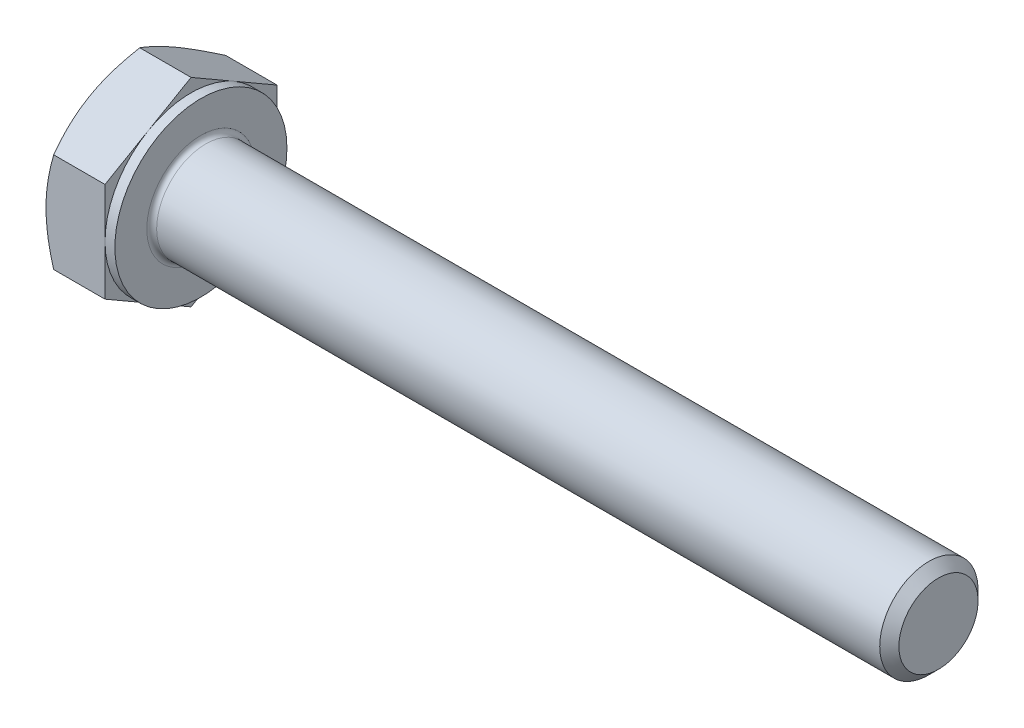
ISO-10303-21;
HEADER;
FILE_DESCRIPTION(('STEP AP214'),'2;1');
FILE_NAME('part.step','',(''),(''),'','','');
FILE_SCHEMA(('AUTOMOTIVE_DESIGN { 1 0 10303 214 1 1 1 1 }'));
ENDSEC;
DATA;
#1=APPLICATION_CONTEXT('core data for automotive mechanical design processes');
#2=APPLICATION_PROTOCOL_DEFINITION('international standard','automotive_design',2000,#1);
#3=PRODUCT_CONTEXT('',#1,'mechanical');
#4=PRODUCT('Part','Part','',(#3));
#5=PRODUCT_RELATED_PRODUCT_CATEGORY('part','',(#4));
#6=PRODUCT_DEFINITION_FORMATION('','',#4);
#7=PRODUCT_DEFINITION_CONTEXT('part definition',#1,'design');
#8=PRODUCT_DEFINITION('design','',#6,#7);
#9=PRODUCT_DEFINITION_SHAPE('','',#8);
#10=(LENGTH_UNIT() NAMED_UNIT(*) SI_UNIT(.MILLI.,.METRE.));
#11=(NAMED_UNIT(*) PLANE_ANGLE_UNIT() SI_UNIT($,.RADIAN.));
#12=(NAMED_UNIT(*) SI_UNIT($,.STERADIAN.) SOLID_ANGLE_UNIT());
#13=UNCERTAINTY_MEASURE_WITH_UNIT(LENGTH_MEASURE(1.E-05),#10,'distance_accuracy_value','');
#14=(GEOMETRIC_REPRESENTATION_CONTEXT(3) GLOBAL_UNCERTAINTY_ASSIGNED_CONTEXT((#13)) GLOBAL_UNIT_ASSIGNED_CONTEXT((#10,
#11,#12)) REPRESENTATION_CONTEXT('',''));
#15=CARTESIAN_POINT('',(0.,0.,0.));
#16=DIRECTION('',(0.,0.,1.));
#17=DIRECTION('',(1.,0.,0.));
#18=AXIS2_PLACEMENT_3D('',#15,#16,#17);
#19=CARTESIAN_POINT('',(2.8,4.04145188432738,0.));
#20=DIRECTION('',(1.,0.,0.));
#21=DIRECTION('',(0.,0.,-1.));
#22=AXIS2_PLACEMENT_3D('',#19,#20,#21);
#23=PLANE('',#22);
#24=CARTESIAN_POINT('',(2.8,0.,0.));
#25=DIRECTION('',(1.,0.,0.));
#26=DIRECTION('',(0.,0.,-1.));
#27=AXIS2_PLACEMENT_3D('',#24,#25,#26);
#28=CIRCLE('',#27,2.2);
#29=CARTESIAN_POINT('',(2.8,0.,-2.2));
#30=VERTEX_POINT('',#29);
#31=EDGE_CURVE('E42',#30,#30,#28,.F.);
#32=ORIENTED_EDGE('',*,*,#31,.T.);
#33=EDGE_LOOP('',(#32));
#34=FACE_BOUND('',#33,.T.);
#35=CARTESIAN_POINT('',(2.8,0.,0.));
#36=DIRECTION('',(1.,0.,0.));
#37=DIRECTION('',(0.,0.,-1.));
#38=AXIS2_PLACEMENT_3D('',#35,#36,#37);
#39=CIRCLE('',#38,3.5);
#40=CARTESIAN_POINT('',(2.8,0.,-3.5));
#41=VERTEX_POINT('',#40);
#42=EDGE_CURVE('E293',#41,#41,#39,.T.);
#43=ORIENTED_EDGE('',*,*,#42,.T.);
#44=EDGE_LOOP('',(#43));
#45=FACE_BOUND('',#44,.T.);
#46=ADVANCED_FACE('F34',(#34,#45),#23,.T.);
#47=CARTESIAN_POINT('',(0.,0.,0.));
#48=DIRECTION('',(-1.,0.,0.));
#49=DIRECTION('',(0.,0.,1.));
#50=AXIS2_PLACEMENT_3D('',#47,#48,#49);
#51=CYLINDRICAL_SURFACE('',#50,2.);
#52=CARTESIAN_POINT('',(3.,0.,0.));
#53=DIRECTION('',(1.,0.,0.));
#54=DIRECTION('',(0.,0.,-1.));
#55=AXIS2_PLACEMENT_3D('',#52,#53,#54);
#56=CIRCLE('',#55,2.);
#57=CARTESIAN_POINT('',(3.,0.,-2.));
#58=VERTEX_POINT('',#57);
#59=EDGE_CURVE('E11',#58,#58,#56,.T.);
#60=ORIENTED_EDGE('',*,*,#59,.T.);
#61=EDGE_LOOP('',(#60));
#62=FACE_BOUND('',#61,.T.);
#63=CARTESIAN_POINT('',(32.41,0.,0.));
#64=DIRECTION('',(-1.,0.,0.));
#65=DIRECTION('',(0.,0.,1.));
#66=AXIS2_PLACEMENT_3D('',#63,#64,#65);
#67=CIRCLE('',#66,2.);
#68=CARTESIAN_POINT('',(32.41,0.,2.));
#69=VERTEX_POINT('',#68);
#70=EDGE_CURVE('E272',#69,#69,#67,.T.);
#71=ORIENTED_EDGE('',*,*,#70,.T.);
#72=EDGE_LOOP('',(#71));
#73=FACE_BOUND('',#72,.T.);
#74=ADVANCED_FACE('F246',(#62,#73),#51,.T.);
#75=CARTESIAN_POINT('',(32.8,0.,0.));
#76=DIRECTION('',(-1.,0.,0.));
#77=DIRECTION('',(0.,0.,1.));
#78=AXIS2_PLACEMENT_3D('',#75,#76,#77);
#79=CONICAL_SURFACE('',#78,1.61,0.785398163397446);
#80=ORIENTED_EDGE('',*,*,#70,.F.);
#81=EDGE_LOOP('',(#80));
#82=FACE_BOUND('',#81,.T.);
#83=CARTESIAN_POINT('',(32.8,0.,0.));
#84=DIRECTION('',(-1.,0.,0.));
#85=DIRECTION('',(0.,0.,1.));
#86=AXIS2_PLACEMENT_3D('',#83,#84,#85);
#87=CIRCLE('',#86,1.61);
#88=CARTESIAN_POINT('',(32.8,0.,1.61));
#89=VERTEX_POINT('',#88);
#90=EDGE_CURVE('E270',#89,#89,#87,.T.);
#91=ORIENTED_EDGE('',*,*,#90,.T.);
#92=EDGE_LOOP('',(#91));
#93=FACE_BOUND('',#92,.T.);
#94=ADVANCED_FACE('F251',(#82,#93),#79,.T.);
#95=CARTESIAN_POINT('',(32.8,0.,0.));
#96=DIRECTION('',(-1.,0.,0.));
#97=DIRECTION('',(0.,0.,1.));
#98=AXIS2_PLACEMENT_3D('',#95,#96,#97);
#99=PLANE('',#98);
#100=ORIENTED_EDGE('',*,*,#90,.F.);
#101=EDGE_LOOP('',(#100));
#102=FACE_BOUND('',#101,.T.);
#103=ADVANCED_FACE('F258',(#102),#99,.F.);
#104=CARTESIAN_POINT('',(2.4,3.5,0.));
#105=DIRECTION('',(1.,0.,0.));
#106=DIRECTION('',(0.,0.,-1.));
#107=AXIS2_PLACEMENT_3D('',#104,#105,#106);
#108=PLANE('',#107);
#109=DIRECTION('',(0.,0.500000000000001,0.866025403784438));
#110=VECTOR('',#109,1.);
#111=CARTESIAN_POINT('',(2.4,2.02072594216369,-3.5));
#112=LINE('',#111,#110);
#113=CARTESIAN_POINT('',(2.4,2.02072594216369,-3.5));
#114=VERTEX_POINT('',#113);
#115=CARTESIAN_POINT('',(2.4,3.03108891324553,-1.75));
#116=VERTEX_POINT('',#115);
#117=EDGE_CURVE('E166',#114,#116,#112,.T.);
#118=ORIENTED_EDGE('',*,*,#117,.T.);
#119=CARTESIAN_POINT('',(2.4,0.,0.));
#120=DIRECTION('',(-1.,0.,0.));
#121=DIRECTION('',(0.,0.,1.));
#122=AXIS2_PLACEMENT_3D('',#119,#120,#121);
#123=CIRCLE('',#122,3.5);
#124=CARTESIAN_POINT('',(2.4,0.,-3.5));
#125=VERTEX_POINT('',#124);
#126=EDGE_CURVE('E49',#116,#125,#123,.T.);
#127=ORIENTED_EDGE('',*,*,#126,.T.);
#128=DIRECTION('',(0.,1.,0.));
#129=VECTOR('',#128,1.);
#130=CARTESIAN_POINT('',(2.4,2.02072594216369,-3.5));
#131=LINE('',#130,#129);
#132=EDGE_CURVE('E296',#125,#114,#131,.T.);
#133=ORIENTED_EDGE('',*,*,#132,.T.);
#134=EDGE_LOOP('',(#118,#127,#133));
#135=FACE_BOUND('',#134,.T.);
#136=ADVANCED_FACE('F261',(#135),#108,.T.);
#137=CARTESIAN_POINT('',(2.4,4.04145188432738,0.));
#138=VERTEX_POINT('',#137);
#139=EDGE_CURVE('E164',#116,#138,#112,.T.);
#140=ORIENTED_EDGE('',*,*,#139,.T.);
#141=DIRECTION('',(0.,-0.500000000000001,0.866025403784438));
#142=VECTOR('',#141,1.);
#143=CARTESIAN_POINT('',(2.4,4.04145188432738,0.));
#144=LINE('',#143,#142);
#145=CARTESIAN_POINT('',(2.4,3.03108891324553,1.75));
#146=VERTEX_POINT('',#145);
#147=EDGE_CURVE('E163',#138,#146,#144,.T.);
#148=ORIENTED_EDGE('',*,*,#147,.T.);
#149=EDGE_CURVE('E152',#146,#116,#123,.T.);
#150=ORIENTED_EDGE('',*,*,#149,.T.);
#151=EDGE_LOOP('',(#140,#148,#150));
#152=FACE_BOUND('',#151,.T.);
#153=ADVANCED_FACE('F266',(#152),#108,.T.);
#154=CARTESIAN_POINT('',(2.4,2.02072594216369,3.5));
#155=VERTEX_POINT('',#154);
#156=EDGE_CURVE('E131',#146,#155,#144,.T.);
#157=ORIENTED_EDGE('',*,*,#156,.T.);
#158=DIRECTION('',(0.,-1.,0.));
#159=VECTOR('',#158,1.);
#160=CARTESIAN_POINT('',(2.4,2.02072594216369,3.5));
#161=LINE('',#160,#159);
#162=CARTESIAN_POINT('',(2.4,0.,3.5));
#163=VERTEX_POINT('',#162);
#164=EDGE_CURVE('E125',#155,#163,#161,.T.);
#165=ORIENTED_EDGE('',*,*,#164,.T.);
#166=EDGE_CURVE('E129',#163,#146,#123,.T.);
#167=ORIENTED_EDGE('',*,*,#166,.T.);
#168=EDGE_LOOP('',(#157,#165,#167));
#169=FACE_BOUND('',#168,.T.);
#170=ADVANCED_FACE('F127',(#169),#108,.T.);
#171=CARTESIAN_POINT('',(2.4,-2.02072594216369,3.5));
#172=VERTEX_POINT('',#171);
#173=EDGE_CURVE('E135',#163,#172,#161,.T.);
#174=ORIENTED_EDGE('',*,*,#173,.T.);
#175=DIRECTION('',(0.,-0.500000000000002,-0.866025403784438));
#176=VECTOR('',#175,1.);
#177=CARTESIAN_POINT('',(2.4,-4.04145188432739,0.));
#178=LINE('',#177,#176);
#179=CARTESIAN_POINT('',(2.4,-3.03108891324553,1.75000000000001));
#180=VERTEX_POINT('',#179);
#181=EDGE_CURVE('E142',#172,#180,#178,.T.);
#182=ORIENTED_EDGE('',*,*,#181,.T.);
#183=EDGE_CURVE('E139',#180,#163,#123,.T.);
#184=ORIENTED_EDGE('',*,*,#183,.T.);
#185=EDGE_LOOP('',(#174,#182,#184));
#186=FACE_BOUND('',#185,.T.);
#187=ADVANCED_FACE('F140',(#186),#108,.T.);
#188=CARTESIAN_POINT('',(2.4,-4.04145188432739,0.));
#189=VERTEX_POINT('',#188);
#190=EDGE_CURVE('E158',#180,#189,#178,.T.);
#191=ORIENTED_EDGE('',*,*,#190,.T.);
#192=DIRECTION('',(0.,0.5,-0.866025403784439));
#193=VECTOR('',#192,1.);
#194=CARTESIAN_POINT('',(2.4,-2.02072594216369,-3.5));
#195=LINE('',#194,#193);
#196=CARTESIAN_POINT('',(2.4,-3.03108891324553,-1.75));
#197=VERTEX_POINT('',#196);
#198=EDGE_CURVE('E334',#189,#197,#195,.T.);
#199=ORIENTED_EDGE('',*,*,#198,.T.);
#200=EDGE_CURVE('E146',#197,#180,#123,.T.);
#201=ORIENTED_EDGE('',*,*,#200,.T.);
#202=EDGE_LOOP('',(#191,#199,#201));
#203=FACE_BOUND('',#202,.T.);
#204=ADVANCED_FACE('F335',(#203),#108,.T.);
#205=CARTESIAN_POINT('',(2.4,-2.0207259421637,-3.5));
#206=VERTEX_POINT('',#205);
#207=EDGE_CURVE('E153',#197,#206,#195,.T.);
#208=ORIENTED_EDGE('',*,*,#207,.T.);
#209=EDGE_CURVE('E297',#206,#125,#131,.T.);
#210=ORIENTED_EDGE('',*,*,#209,.T.);
#211=EDGE_CURVE('E304',#125,#197,#123,.T.);
#212=ORIENTED_EDGE('',*,*,#211,.T.);
#213=EDGE_LOOP('',(#208,#210,#212));
#214=FACE_BOUND('',#213,.T.);
#215=ADVANCED_FACE('F267',(#214),#108,.T.);
#216=CARTESIAN_POINT('',(0.,0.,0.));
#217=DIRECTION('',(-1.,0.,0.));
#218=DIRECTION('',(0.,0.,1.));
#219=AXIS2_PLACEMENT_3D('',#216,#217,#218);
#220=CYLINDRICAL_SURFACE('',#219,3.5);
#221=ORIENTED_EDGE('',*,*,#126,.F.);
#222=ORIENTED_EDGE('',*,*,#149,.F.);
#223=ORIENTED_EDGE('',*,*,#166,.F.);
#224=ORIENTED_EDGE('',*,*,#183,.F.);
#225=ORIENTED_EDGE('',*,*,#200,.F.);
#226=ORIENTED_EDGE('',*,*,#211,.F.);
#227=EDGE_LOOP('',(#221,#222,#223,#224,#225,#226));
#228=FACE_BOUND('',#227,.T.);
#229=ORIENTED_EDGE('',*,*,#42,.F.);
#230=EDGE_LOOP('',(#229));
#231=FACE_BOUND('',#230,.T.);
#232=ADVANCED_FACE('F149',(#228,#231),#220,.T.);
#233=CARTESIAN_POINT('',(0.,4.04145188432738,0.));
#234=DIRECTION('',(1.,0.,0.));
#235=DIRECTION('',(0.,0.,-1.));
#236=AXIS2_PLACEMENT_3D('',#233,#234,#235);
#237=PLANE('',#236);
#238=CARTESIAN_POINT('',(0.,0.,0.));
#239=DIRECTION('',(1.,0.,0.));
#240=DIRECTION('',(0.,0.,-1.));
#241=AXIS2_PLACEMENT_3D('',#238,#239,#240);
#242=CIRCLE('',#241,3.5);
#243=CARTESIAN_POINT('',(0.,0.,-3.5));
#244=VERTEX_POINT('',#243);
#245=CARTESIAN_POINT('',(0.,3.03108891324553,-1.75));
#246=VERTEX_POINT('',#245);
#247=EDGE_CURVE('E292',#244,#246,#242,.T.);
#248=ORIENTED_EDGE('',*,*,#247,.F.);
#249=CARTESIAN_POINT('',(0.,-3.03108891324553,-1.75));
#250=VERTEX_POINT('',#249);
#251=EDGE_CURVE('E288',#250,#244,#242,.T.);
#252=ORIENTED_EDGE('',*,*,#251,.F.);
#253=CARTESIAN_POINT('',(0.,-3.03108891324553,1.75000000000001));
#254=VERTEX_POINT('',#253);
#255=EDGE_CURVE('E291',#254,#250,#242,.T.);
#256=ORIENTED_EDGE('',*,*,#255,.F.);
#257=CARTESIAN_POINT('',(0.,0.,3.5));
#258=VERTEX_POINT('',#257);
#259=EDGE_CURVE('E327',#258,#254,#242,.T.);
#260=ORIENTED_EDGE('',*,*,#259,.F.);
#261=CARTESIAN_POINT('',(0.,0.,0.));
#262=DIRECTION('',(-1.,0.,0.));
#263=DIRECTION('',(0.,0.,1.));
#264=AXIS2_PLACEMENT_3D('',#261,#262,#263);
#265=CIRCLE('',#264,3.5);
#266=CARTESIAN_POINT('',(0.,3.03108891324553,1.75));
#267=VERTEX_POINT('',#266);
#268=EDGE_CURVE('E167',#258,#267,#265,.T.);
#269=ORIENTED_EDGE('',*,*,#268,.T.);
#270=EDGE_CURVE('E350',#246,#267,#242,.T.);
#271=ORIENTED_EDGE('',*,*,#270,.F.);
#272=EDGE_LOOP('',(#248,#252,#256,#260,#269,#271));
#273=FACE_BOUND('',#272,.T.);
#274=ADVANCED_FACE('F196',(#273),#237,.F.);
#275=CARTESIAN_POINT('',(0.,0.,0.));
#276=DIRECTION('',(1.,0.,0.));
#277=DIRECTION('',(0.,0.,-1.));
#278=AXIS2_PLACEMENT_3D('',#275,#276,#277);
#279=CONICAL_SURFACE('',#278,3.5,1.0471975511966);
#280=CARTESIAN_POINT('',(0.312674060693369,2.02061047210985,3.5002));
#281=CARTESIAN_POINT('',(0.261385788989982,2.10941108799267,3.34639282154755));
#282=CARTESIAN_POINT('',(0.214740953816195,2.19897822522909,3.19125798916558));
#283=CARTESIAN_POINT('',(0.133321875533347,2.37966345361545,2.87830199342322));
#284=CARTESIAN_POINT('',(0.0985764355845603,2.47078475532382,2.72047526921251));
#285=CARTESIAN_POINT('',(0.0444900271828352,2.65189807961073,2.40677778961987));
#286=CARTESIAN_POINT('',(0.0247890862603808,2.74186223545399,2.25095530083931));
#287=CARTESIAN_POINT('',(0.00127013273725381,2.92221386641055,1.93857711279463));
#288=CARTESIAN_POINT('',(-0.00256735545443524,3.01260068598001,1.78202254896577));
#289=CARTESIAN_POINT('',(0.00541530187697727,3.1814939814933,1.48949078007901));
#290=CARTESIAN_POINT('',(0.0152754340696067,3.26002573814993,1.3534697875421));
#291=CARTESIAN_POINT('',(0.0465264668994031,3.41657761679354,1.08231397971101));
#292=CARTESIAN_POINT('',(0.0679280432857977,3.49459719728458,0.947180102315319));
#293=CARTESIAN_POINT('',(0.121430407880577,3.65147186489429,0.675465207594817));
#294=CARTESIAN_POINT('',(0.153757994445087,3.73030709667644,0.538918580721665));
#295=CARTESIAN_POINT('',(0.227128933807994,3.88680174018324,0.267861907055499));
#296=CARTESIAN_POINT('',(0.268155046569867,3.96446315689009,0.133348387531464));
#297=CARTESIAN_POINT('',(0.312674060693371,4.04156735438122,-0.000200000000000089));
#298=B_SPLINE_CURVE_WITH_KNOTS('',3,(#280,#281,#282,#283,#284,#285,#286,#287,#288,#289,#290,
#291,#292,#293,#294,#295,#296,#297),.UNSPECIFIED.,.F.,.F.,(4,2,2,2,2,2,2,2,4),(0.,
0.554793832886253,1.11092123814984,1.65328467083219,2.19498204478403,2.6666513085086,
3.13875761298267,3.6213361260051,4.10296698719187),.UNSPECIFIED.);
#299=CARTESIAN_POINT('',(0.312607391169643,4.04145188432738,0.));
#300=VERTEX_POINT('',#299);
#301=EDGE_CURVE('E215',#267,#300,#298,.T.);
#302=ORIENTED_EDGE('',*,*,#301,.T.);
#303=CARTESIAN_POINT('',(0.312674060693371,4.04156735438122,0.0002));
#304=CARTESIAN_POINT('',(0.261385788989983,3.9527667384984,-0.15360717845245));
#305=CARTESIAN_POINT('',(0.214740953816197,3.86319960126198,-0.308742010834424));
#306=CARTESIAN_POINT('',(0.133321875533349,3.68251437287562,-0.621698006576781));
#307=CARTESIAN_POINT('',(0.0985764355845613,3.59139307116725,-0.779524730787495));
#308=CARTESIAN_POINT('',(0.0444900271828358,3.41027974688034,-1.09322221038013));
#309=CARTESIAN_POINT('',(0.024789086260381,3.32031559103708,-1.24904469916069));
#310=CARTESIAN_POINT('',(0.00127013273725357,3.13996396008051,-1.56142288720537));
#311=CARTESIAN_POINT('',(-0.00256735545443566,3.04957714051106,-1.71797745103423));
#312=CARTESIAN_POINT('',(0.00541530187697658,2.88068384499777,-2.01050921992099));
#313=CARTESIAN_POINT('',(0.0152754340696059,2.80215208834114,-2.14653021245791));
#314=CARTESIAN_POINT('',(0.046526466899402,2.64560020969753,-2.41768602028899));
#315=CARTESIAN_POINT('',(0.0679280432857964,2.56758062920649,-2.55281989768468));
#316=CARTESIAN_POINT('',(0.121430407880575,2.41070596159678,-2.82453479240518));
#317=CARTESIAN_POINT('',(0.153757994445085,2.33187072981463,-2.96108141927833));
#318=CARTESIAN_POINT('',(0.227128933807992,2.17537608630783,-3.2321380929445));
#319=CARTESIAN_POINT('',(0.268155046569864,2.09771466960098,-3.36665161246854));
#320=CARTESIAN_POINT('',(0.312674060693368,2.02061047210985,-3.5002));
#321=B_SPLINE_CURVE_WITH_KNOTS('',3,(#303,#304,#305,#306,#307,#308,#309,#310,#311,#312,#313,
#314,#315,#316,#317,#318,#319,#320),.UNSPECIFIED.,.F.,.F.,(4,2,2,2,2,2,2,2,4),(0.,
0.554793832886254,1.11092123814984,1.65328467083219,2.19498204478403,2.6666513085086,
3.13875761298267,3.6213361260051,4.10296698719187),.UNSPECIFIED.);
#322=EDGE_CURVE('E57',#300,#246,#321,.T.);
#323=ORIENTED_EDGE('',*,*,#322,.T.);
#324=ORIENTED_EDGE('',*,*,#270,.T.);
#325=EDGE_LOOP('',(#302,#323,#324));
#326=FACE_BOUND('',#325,.T.);
#327=ADVANCED_FACE('F351',(#326),#279,.T.);
#328=CARTESIAN_POINT('',(1.74876972157984,-5.51155991321368,3.5));
#329=CARTESIAN_POINT('',(1.67392335905171,-5.35795146168119,3.5));
#330=CARTESIAN_POINT('',(1.59977092482585,-5.20399921009227,3.5));
#331=CARTESIAN_POINT('',(1.45324265085096,-4.8952245487294,3.5));
#332=CARTESIAN_POINT('',(1.38086707569563,-4.74040201352887,3.5));
#333=CARTESIAN_POINT('',(1.23793493282186,-4.42894615034127,3.5));
#334=CARTESIAN_POINT('',(1.16738971082227,-4.27230759822601,3.5));
#335=CARTESIAN_POINT('',(1.02907715104181,-3.95781335182266,3.5));
#336=CARTESIAN_POINT('',(0.961309687300873,-3.79995771311101,3.5));
#337=CARTESIAN_POINT('',(0.827049257300864,-3.47741113153964,3.5));
#338=CARTESIAN_POINT('',(0.760677039603636,-3.31266966015406,3.5));
#339=CARTESIAN_POINT('',(0.63275639066045,-2.98129055183973,3.5));
#340=CARTESIAN_POINT('',(0.571208488744781,-2.81465270912934,3.5));
#341=CARTESIAN_POINT('',(0.454490935223124,-2.47950135030688,3.5));
#342=CARTESIAN_POINT('',(0.399309072211479,-2.31099212862995,3.5));
#343=CARTESIAN_POINT('',(0.297038623006435,-1.97155788003879,3.5));
#344=CARTESIAN_POINT('',(0.249947575310255,-1.80063360505406,3.5));
#345=CARTESIAN_POINT('',(0.166312731854841,-1.45721769418153,3.5));
#346=CARTESIAN_POINT('',(0.129709932807452,-1.28474069128699,3.5));
#347=CARTESIAN_POINT('',(0.0690664438522151,-0.937557025087306,3.5));
#348=CARTESIAN_POINT('',(0.0450243878605917,-0.762850606367491,3.5));
#349=CARTESIAN_POINT('',(0.011730799131724,-0.414396256841872,3.5));
#350=CARTESIAN_POINT('',(0.00228260582206911,-0.240667592567804,3.5));
#351=CARTESIAN_POINT('',(-0.00154556659444926,0.106974360360041,3.5));
#352=CARTESIAN_POINT('',(0.00407467645780506,0.280887651698049,3.5));
#353=CARTESIAN_POINT('',(0.0258160054827262,0.573677729994466,3.5));
#354=CARTESIAN_POINT('',(0.0381294862842107,0.692856453275206,3.5));
#355=CARTESIAN_POINT('',(0.0691104272904716,0.930390570440097,3.5));
#356=CARTESIAN_POINT('',(0.0877786801448149,1.0487458597347,3.5));
#357=CARTESIAN_POINT('',(0.15233939530696,1.40238821087658,3.5));
#358=CARTESIAN_POINT('',(0.206777964143632,1.63613518036602,3.5));
#359=CARTESIAN_POINT('',(0.301818253018761,1.98584040729013,3.5));
#360=CARTESIAN_POINT('',(0.336200477312345,2.10359260573208,3.5));
#361=CARTESIAN_POINT('',(0.408694225276311,2.33795452904033,3.5));
#362=CARTESIAN_POINT('',(0.446805777714552,2.45456424508595,3.5));
#363=CARTESIAN_POINT('',(0.526133500138822,2.68667648503231,3.5));
#364=CARTESIAN_POINT('',(0.567348796819715,2.80217931014604,3.5));
#365=CARTESIAN_POINT('',(0.652383318084223,3.03221622177693,3.5));
#366=CARTESIAN_POINT('',(0.696202482848101,3.14675033047982,3.5));
#367=CARTESIAN_POINT('',(0.817586419233476,3.45518824474219,3.5));
#368=CARTESIAN_POINT('',(0.897216282952769,3.64827858337668,3.5));
#369=CARTESIAN_POINT('',(1.06116121653101,4.03246733734999,3.5));
#370=CARTESIAN_POINT('',(1.14547680839181,4.22356552793098,3.5));
#371=CARTESIAN_POINT('',(1.31768022375103,4.60422080078618,3.5));
#372=CARTESIAN_POINT('',(1.4055692882719,4.79377731975281,3.5));
#373=CARTESIAN_POINT('',(1.58407294204471,5.17160542987796,3.5));
#374=CARTESIAN_POINT('',(1.67468761529442,5.35987698121653,3.5));
#375=CARTESIAN_POINT('',(1.85818750847656,5.73567568183913,3.5));
#376=CARTESIAN_POINT('',(1.95107608160113,5.92320119040396,3.5));
#377=CARTESIAN_POINT('',(2.13854805032034,6.29740401332884,3.5));
#378=CARTESIAN_POINT('',(2.23313146399146,6.48408131861562,3.5));
#379=CARTESIAN_POINT('',(2.51886264902323,7.04299370579128,3.5));
#380=CARTESIAN_POINT('',(2.71203324129307,7.41419418594084,3.5));
#381=CARTESIAN_POINT('',(3.08131090771227,8.11545297373331,3.5));
#382=CARTESIAN_POINT('',(3.25705679900321,8.44570240603793,3.5));
#383=CARTESIAN_POINT('',(3.61066708019842,9.10509095269335,3.5));
#384=CARTESIAN_POINT('',(3.7885316009934,9.43422999681451,3.5));
#385=CARTESIAN_POINT('',(4.14522643131462,10.0905480448887,3.5));
#386=CARTESIAN_POINT('',(4.32405147197678,10.4177299168719,3.5));
#387=CARTESIAN_POINT('',(4.68290305302711,11.0714005801046,3.5));
#388=CARTESIAN_POINT('',(4.86292949694073,11.397889424295,3.5));
#389=CARTESIAN_POINT('',(5.04339321716841,11.7241348717818,3.5));
#390=B_SPLINE_CURVE_WITH_KNOTS('',3,(#328,#329,#330,#331,#332,#333,#334,#335,#336,#337,#338,
#339,#340,#341,#342,#343,#344,#345,#346,#347,#348,#349,#350,#351,#352,#353,#354,#355,#356,#357,
#358,#359,#360,#361,#362,#363,#364,#365,#366,#367,#368,#369,#370,#371,#372,#373,#374,#375,#376,
#377,#378,#379,#380,#381,#382,#383,#384,#385,#386,#387,#388,#389),.UNSPECIFIED.,.F.,.F.,(4,2,2,
2,2,2,2,2,2,2,2,2,2,2,2,2,2,2,2,2,2,2,2,2,2,2,2,2,2,2,4),(0.,0.512624455055138,1.02532478807013,
1.54067716579031,2.05600614845993,2.58877526662742,3.12160275933496,3.6533905567045,
4.18501627844402,4.71358974605644,5.24210571499795,5.76343550148056,6.28477297414901,
6.64403977227186,7.00335139923843,7.72232402023061,8.0902978978206,8.45827461416729,
8.82614817645966,9.1940132907056,9.82051720102627,10.4470910459092,11.0738843824793,
11.7006970553932,12.3284975462801,12.9563047370264,14.2116350789245,15.333929259245,
16.4562931392235,17.5748776783279,18.6933734490332),.UNSPECIFIED.);
#391=CARTESIAN_POINT('',(0.312607391169641,2.02072594216369,3.5));
#392=VERTEX_POINT('',#391);
#393=EDGE_CURVE('E227',#258,#392,#390,.T.);
#394=ORIENTED_EDGE('',*,*,#393,.T.);
#395=EDGE_CURVE('E226',#392,#267,#298,.T.);
#396=ORIENTED_EDGE('',*,*,#395,.T.);
#397=ORIENTED_EDGE('',*,*,#268,.F.);
#398=EDGE_LOOP('',(#394,#396,#397));
#399=FACE_BOUND('',#398,.T.);
#400=ADVANCED_FACE('F321',(#399),#279,.T.);
#401=CARTESIAN_POINT('',(0.31260739116964,-2.02072594216369,3.5));
#402=VERTEX_POINT('',#401);
#403=EDGE_CURVE('E273',#402,#258,#390,.T.);
#404=ORIENTED_EDGE('',*,*,#403,.T.);
#405=ORIENTED_EDGE('',*,*,#259,.T.);
#406=CARTESIAN_POINT('',(0.312674060693373,-4.04156735438122,-0.000200000000000053));
#407=CARTESIAN_POINT('',(0.261385788989985,-3.95276673849841,0.15360717845245));
#408=CARTESIAN_POINT('',(0.214740953816198,-3.86319960126198,0.308742010834424));
#409=CARTESIAN_POINT('',(0.13332187553335,-3.68251437287563,0.621698006576781));
#410=CARTESIAN_POINT('',(0.0985764355845628,-3.59139307116725,0.779524730787495));
#411=CARTESIAN_POINT('',(0.0444900271828372,-3.41027974688034,1.09322221038013));
#412=CARTESIAN_POINT('',(0.0247890862603823,-3.32031559103708,1.24904469916069));
#413=CARTESIAN_POINT('',(0.00127013273725469,-3.13996396008052,1.56142288720537));
#414=CARTESIAN_POINT('',(-0.00256735545443454,-3.04957714051106,1.71797745103423));
#415=CARTESIAN_POINT('',(0.00541530187697736,-2.88068384499777,2.01050921992099));
#416=CARTESIAN_POINT('',(0.0152754340696064,-2.80215208834114,2.14653021245791));
#417=CARTESIAN_POINT('',(0.0465264668994024,-2.64560020969753,2.41768602028899));
#418=CARTESIAN_POINT('',(0.067928043285797,-2.56758062920649,2.55281989768468));
#419=CARTESIAN_POINT('',(0.121430407880575,-2.41070596159678,2.82453479240518));
#420=CARTESIAN_POINT('',(0.153757994445085,-2.33187072981463,2.96108141927834));
#421=CARTESIAN_POINT('',(0.227128933807992,-2.17537608630782,3.2321380929445));
#422=CARTESIAN_POINT('',(0.268155046569864,-2.09771466960098,3.36665161246854));
#423=CARTESIAN_POINT('',(0.312674060693368,-2.02061047210985,3.5002));
#424=B_SPLINE_CURVE_WITH_KNOTS('',3,(#406,#407,#408,#409,#410,#411,#412,#413,#414,#415,#416,
#417,#418,#419,#420,#421,#422,#423),.UNSPECIFIED.,.F.,.F.,(4,2,2,2,2,2,2,2,4),(0.,
0.554793832886255,1.11092123814984,1.65328467083219,2.19498204478403,2.6666513085086,
3.13875761298268,3.6213361260051,4.10296698719188),.UNSPECIFIED.);
#425=EDGE_CURVE('E217',#254,#402,#424,.T.);
#426=ORIENTED_EDGE('',*,*,#425,.T.);
#427=EDGE_LOOP('',(#404,#405,#426));
#428=FACE_BOUND('',#427,.T.);
#429=ADVANCED_FACE('F185',(#428),#279,.T.);
#430=CARTESIAN_POINT('',(0.312607391169645,-4.04145188432739,0.));
#431=VERTEX_POINT('',#430);
#432=EDGE_CURVE('E210',#431,#254,#424,.T.);
#433=ORIENTED_EDGE('',*,*,#432,.T.);
#434=ORIENTED_EDGE('',*,*,#255,.T.);
#435=CARTESIAN_POINT('',(0.312674060693371,-2.02061047210986,-3.5002));
#436=CARTESIAN_POINT('',(0.261385788989983,-2.10941108799268,-3.34639282154755));
#437=CARTESIAN_POINT('',(0.214740953816197,-2.1989782252291,-3.19125798916558));
#438=CARTESIAN_POINT('',(0.13332187553335,-2.37966345361545,-2.87830199342322));
#439=CARTESIAN_POINT('',(0.0985764355845627,-2.47078475532383,-2.7204752692125));
#440=CARTESIAN_POINT('',(0.0444900271828377,-2.65189807961074,-2.40677778961987));
#441=CARTESIAN_POINT('',(0.0247890862603832,-2.741862235454,-2.25095530083931));
#442=CARTESIAN_POINT('',(0.00127013273725643,-2.92221386641056,-1.93857711279463));
#443=CARTESIAN_POINT('',(-0.00256735545443231,-3.01260068598002,-1.78202254896577));
#444=CARTESIAN_POINT('',(0.00541530187698033,-3.1814939814933,-1.48949078007901));
#445=CARTESIAN_POINT('',(0.0152754340696096,-3.26002573814993,-1.35346978754209));
#446=CARTESIAN_POINT('',(0.0465264668994061,-3.41657761679354,-1.08231397971101));
#447=CARTESIAN_POINT('',(0.0679280432858009,-3.49459719728458,-0.947180102315317));
#448=CARTESIAN_POINT('',(0.12143040788058,-3.65147186489429,-0.675465207594816));
#449=CARTESIAN_POINT('',(0.153757994445089,-3.73030709667644,-0.538918580721664));
#450=CARTESIAN_POINT('',(0.227128933807996,-3.88680174018325,-0.267861907055498));
#451=CARTESIAN_POINT('',(0.268155046569868,-3.96446315689009,-0.133348387531463));
#452=CARTESIAN_POINT('',(0.312674060693372,-4.04156735438122,0.000200000000000162));
#453=B_SPLINE_CURVE_WITH_KNOTS('',3,(#435,#436,#437,#438,#439,#440,#441,#442,#443,#444,#445,
#446,#447,#448,#449,#450,#451,#452),.UNSPECIFIED.,.F.,.F.,(4,2,2,2,2,2,2,2,4),(0.,
0.554793832886253,1.11092123814984,1.65328467083219,2.19498204478403,2.6666513085086,
3.13875761298267,3.6213361260051,4.10296698719187),.UNSPECIFIED.);
#454=EDGE_CURVE('E216',#250,#431,#453,.T.);
#455=ORIENTED_EDGE('',*,*,#454,.T.);
#456=EDGE_LOOP('',(#433,#434,#455));
#457=FACE_BOUND('',#456,.T.);
#458=ADVANCED_FACE('F349',(#457),#279,.T.);
#459=CARTESIAN_POINT('',(0.31260739116964,2.02072594216369,-3.5));
#460=VERTEX_POINT('',#459);
#461=EDGE_CURVE('E218',#246,#460,#321,.T.);
#462=ORIENTED_EDGE('',*,*,#461,.T.);
#463=CARTESIAN_POINT('',(1.74876972324083,-5.51155991662167,-3.5));
#464=CARTESIAN_POINT('',(1.6739233606435,-5.35795146497443,-3.5));
#465=CARTESIAN_POINT('',(1.59977092634847,-5.20399921327068,-3.5));
#466=CARTESIAN_POINT('',(1.45324265223558,-4.89522455167779,-3.5));
#467=CARTESIAN_POINT('',(1.38086707701141,-4.74040201636208,-3.5));
#468=CARTESIAN_POINT('',(1.23793493399994,-4.4289461529424,-3.5));
#469=CARTESIAN_POINT('',(1.1673897119315,-4.27230760071022,-3.5));
#470=CARTESIAN_POINT('',(1.02907715201446,-3.95781335407225,-3.5));
#471=CARTESIAN_POINT('',(0.9613096882058,-3.79995771524291,-3.5));
#472=CARTESIAN_POINT('',(0.827049258068265,-3.4774111334268,-3.5));
#473=CARTESIAN_POINT('',(0.760677040301393,-3.3126696619141,-3.5));
#474=CARTESIAN_POINT('',(0.632756391222601,-2.98129055334351,-3.5));
#475=CARTESIAN_POINT('',(0.57120848924097,-2.81465271050398,-3.5));
#476=CARTESIAN_POINT('',(0.454490935593631,-2.47950135142084,-3.5));
#477=CARTESIAN_POINT('',(0.399309072522248,-2.3109921296124,-3.5));
#478=CARTESIAN_POINT('',(0.297038623207368,-1.97155788075463,-3.5));
#479=CARTESIAN_POINT('',(0.249947575461083,-1.80063360563483,-3.5));
#480=CARTESIAN_POINT('',(0.166312731904446,-1.45721769442351,-3.5));
#481=CARTESIAN_POINT('',(0.12970993280973,-1.28474069132431,-3.5));
#482=CARTESIAN_POINT('',(0.0690664437905977,-0.937557024710317,-3.5));
#483=CARTESIAN_POINT('',(0.0450243877823829,-0.762850605780841,-3.5));
#484=CARTESIAN_POINT('',(0.0117307990577605,-0.414396255839324,-3.5));
#485=CARTESIAN_POINT('',(0.00228260576824199,-0.240667591359061,-3.5));
#486=CARTESIAN_POINT('',(-0.00154556657178802,0.106974361978116,-3.5));
#487=CARTESIAN_POINT('',(0.0040746765368269,0.280887653519263,-3.5));
#488=CARTESIAN_POINT('',(0.0258160056757238,0.573677732069624,-3.5));
#489=CARTESIAN_POINT('',(0.0381294865222865,0.692856455403475,-3.5));
#490=CARTESIAN_POINT('',(0.0691104276210824,0.93039057267218,-3.5));
#491=CARTESIAN_POINT('',(0.0877786805228829,1.04874586201748,-3.5));
#492=CARTESIAN_POINT('',(0.152339395828372,1.40238821330865,-3.5));
#493=CARTESIAN_POINT('',(0.206777964761841,1.63613518289362,-3.5));
#494=CARTESIAN_POINT('',(0.301818253779736,1.9858404099606,-3.5));
#495=CARTESIAN_POINT('',(0.336200478121234,2.10359260845122,-3.5));
#496=CARTESIAN_POINT('',(0.40869422617953,2.33795453185624,-3.5));
#497=CARTESIAN_POINT('',(0.446805778664187,2.45456424794997,-3.5));
#498=CARTESIAN_POINT('',(0.526133501179593,2.68667648799218,-3.5));
#499=CARTESIAN_POINT('',(0.567348797905202,2.80217931315365,-3.5));
#500=CARTESIAN_POINT('',(0.652383319257555,3.03221622488002,-3.5));
#501=CARTESIAN_POINT('',(0.696202484064561,3.14675033363065,-3.5));
#502=CARTESIAN_POINT('',(0.817586420524251,3.45518824791985,-3.5));
#503=CARTESIAN_POINT('',(0.897216284270024,3.64827858653487,-3.5));
#504=CARTESIAN_POINT('',(1.06116121789352,4.03246734047174,-3.5));
#505=CARTESIAN_POINT('',(1.1454768097731,4.22356553103576,-3.5));
#506=CARTESIAN_POINT('',(1.31768022516433,4.60422080385887,-3.5));
#507=CARTESIAN_POINT('',(1.40556928969842,4.79377732281036,-3.5));
#508=CARTESIAN_POINT('',(1.58407294349369,5.17160543290685,-3.5));
#509=CARTESIAN_POINT('',(1.67468761675268,5.35987698423189,-3.5));
#510=CARTESIAN_POINT('',(1.85818750995007,5.73567568482784,-3.5));
#511=CARTESIAN_POINT('',(1.95107608308063,5.92320119337956,-3.5));
#512=CARTESIAN_POINT('',(2.13854805180964,6.29740401627919,-3.5));
#513=CARTESIAN_POINT('',(2.23313146548459,6.48408132155384,-3.5));
#514=CARTESIAN_POINT('',(2.51886265052555,7.04299370869452,-3.5));
#515=CARTESIAN_POINT('',(2.71203324279836,7.41419418882236,-3.5));
#516=CARTESIAN_POINT('',(3.08131090922904,8.11545297659332,-3.5));
#517=CARTESIAN_POINT('',(3.257056800529,8.44570240889787,-3.5));
#518=CARTESIAN_POINT('',(3.61066708174042,9.10509095555402,-3.5));
#519=CARTESIAN_POINT('',(3.78853160254258,9.43422999967597,-3.5));
#520=CARTESIAN_POINT('',(4.14522643287858,10.0905480477554,-3.5));
#521=CARTESIAN_POINT('',(4.32405147354835,10.4177299197431,-3.5));
#522=CARTESIAN_POINT('',(4.68290305461308,11.0714005829853,-3.5));
#523=CARTESIAN_POINT('',(4.86292949853349,11.3978894271807,-3.5));
#524=CARTESIAN_POINT('',(5.04339321876768,11.7241348746726,-3.5));
#525=B_SPLINE_CURVE_WITH_KNOTS('',3,(#463,#464,#465,#466,#467,#468,#469,#470,#471,#472,#473,
#474,#475,#476,#477,#478,#479,#480,#481,#482,#483,#484,#485,#486,#487,#488,#489,#490,#491,#492,
#493,#494,#495,#496,#497,#498,#499,#500,#501,#502,#503,#504,#505,#506,#507,#508,#509,#510,#511,
#512,#513,#514,#515,#516,#517,#518,#519,#520,#521,#522,#523,#524),.UNSPECIFIED.,.F.,.F.,(4,2,2,
2,2,2,2,2,2,2,2,2,2,2,2,2,2,2,2,2,2,2,2,2,2,2,2,2,2,2,4),(0.,0.512624455455558,1.02532478887103,
1.54067716699584,2.05600615007007,2.58877526866933,3.12160276180877,3.65339055960882,
4.18501628177853,4.71358975001966,5.24210571958899,5.76343550668359,6.28477297996433,
6.64403977825953,7.00335140539848,7.72232402673615,8.09029790450666,8.45827462103385,
8.82614818350625,9.19401329793224,9.82051720822946,10.4470910530887,11.0738843896344,
11.7006970625238,12.3284975533834,12.9563047441025,14.211635085947,15.3339292662801,
16.4562931462709,17.574877685398,18.6933734561263),.UNSPECIFIED.);
#526=EDGE_CURVE('E178',#460,#244,#525,.F.);
#527=ORIENTED_EDGE('',*,*,#526,.T.);
#528=ORIENTED_EDGE('',*,*,#247,.T.);
#529=EDGE_LOOP('',(#462,#527,#528));
#530=FACE_BOUND('',#529,.T.);
#531=ADVANCED_FACE('F346',(#530),#279,.T.);
#532=CARTESIAN_POINT('',(0.312607391169535,-2.02072594216386,-3.5));
#533=VERTEX_POINT('',#532);
#534=EDGE_CURVE('E179',#533,#250,#453,.T.);
#535=ORIENTED_EDGE('',*,*,#534,.T.);
#536=ORIENTED_EDGE('',*,*,#251,.T.);
#537=EDGE_CURVE('E170',#244,#533,#525,.F.);
#538=ORIENTED_EDGE('',*,*,#537,.T.);
#539=EDGE_LOOP('',(#535,#536,#538));
#540=FACE_BOUND('',#539,.T.);
#541=ADVANCED_FACE('F194',(#540),#279,.T.);
#542=CARTESIAN_POINT('',(2.8,2.02072594216369,-3.5));
#543=DIRECTION('',(0.,0.,1.));
#544=DIRECTION('',(0.,-1.,0.));
#545=AXIS2_PLACEMENT_3D('',#542,#543,#544);
#546=PLANE('',#545);
#547=ORIENTED_EDGE('',*,*,#209,.F.);
#548=DIRECTION('',(-1.,0.,0.));
#549=VECTOR('',#548,1.);
#550=CARTESIAN_POINT('',(2.8,-2.02072594216369,-3.5));
#551=LINE('',#550,#549);
#552=EDGE_CURVE('E279',#206,#533,#551,.T.);
#553=ORIENTED_EDGE('',*,*,#552,.T.);
#554=ORIENTED_EDGE('',*,*,#537,.F.);
#555=ORIENTED_EDGE('',*,*,#526,.F.);
#556=DIRECTION('',(-1.,0.,0.));
#557=VECTOR('',#556,1.);
#558=CARTESIAN_POINT('',(2.8,2.02072594216369,-3.5));
#559=LINE('',#558,#557);
#560=EDGE_CURVE('E275',#114,#460,#559,.T.);
#561=ORIENTED_EDGE('',*,*,#560,.F.);
#562=ORIENTED_EDGE('',*,*,#132,.F.);
#563=EDGE_LOOP('',(#547,#553,#554,#555,#561,#562));
#564=FACE_BOUND('',#563,.T.);
#565=ADVANCED_FACE('F189',(#564),#546,.F.);
#566=CARTESIAN_POINT('',(2.8,-2.02072594216369,-3.5));
#567=DIRECTION('',(0.,0.866025403784438,0.5));
#568=DIRECTION('',(0.,-0.5,0.866025403784439));
#569=AXIS2_PLACEMENT_3D('',#566,#567,#568);
#570=PLANE('',#569);
#571=ORIENTED_EDGE('',*,*,#198,.F.);
#572=DIRECTION('',(-1.,0.,0.));
#573=VECTOR('',#572,1.);
#574=CARTESIAN_POINT('',(2.8,-4.04145188432739,0.));
#575=LINE('',#574,#573);
#576=EDGE_CURVE('E281',#189,#431,#575,.T.);
#577=ORIENTED_EDGE('',*,*,#576,.T.);
#578=ORIENTED_EDGE('',*,*,#454,.F.);
#579=ORIENTED_EDGE('',*,*,#534,.F.);
#580=ORIENTED_EDGE('',*,*,#552,.F.);
#581=ORIENTED_EDGE('',*,*,#207,.F.);
#582=EDGE_LOOP('',(#571,#577,#578,#579,#580,#581));
#583=FACE_BOUND('',#582,.T.);
#584=ADVANCED_FACE('F193',(#583),#570,.F.);
#585=CARTESIAN_POINT('',(2.8,-4.04145188432739,0.));
#586=DIRECTION('',(0.,0.866025403784438,-0.500000000000002));
#587=DIRECTION('',(0.,0.500000000000002,0.866025403784438));
#588=AXIS2_PLACEMENT_3D('',#585,#586,#587);
#589=PLANE('',#588);
#590=ORIENTED_EDGE('',*,*,#181,.F.);
#591=DIRECTION('',(-1.,0.,0.));
#592=VECTOR('',#591,1.);
#593=CARTESIAN_POINT('',(2.8,-2.02072594216369,3.5));
#594=LINE('',#593,#592);
#595=EDGE_CURVE('E157',#172,#402,#594,.T.);
#596=ORIENTED_EDGE('',*,*,#595,.T.);
#597=ORIENTED_EDGE('',*,*,#425,.F.);
#598=ORIENTED_EDGE('',*,*,#432,.F.);
#599=ORIENTED_EDGE('',*,*,#576,.F.);
#600=ORIENTED_EDGE('',*,*,#190,.F.);
#601=EDGE_LOOP('',(#590,#596,#597,#598,#599,#600));
#602=FACE_BOUND('',#601,.T.);
#603=ADVANCED_FACE('F201',(#602),#589,.F.);
#604=CARTESIAN_POINT('',(2.8,2.02072594216369,3.5));
#605=DIRECTION('',(0.,0.,-1.));
#606=DIRECTION('',(-1.,0.,0.));
#607=AXIS2_PLACEMENT_3D('',#604,#605,#606);
#608=PLANE('',#607);
#609=ORIENTED_EDGE('',*,*,#164,.F.);
#610=DIRECTION('',(-1.,0.,0.));
#611=VECTOR('',#610,1.);
#612=CARTESIAN_POINT('',(2.8,2.02072594216369,3.5));
#613=LINE('',#612,#611);
#614=EDGE_CURVE('E284',#155,#392,#613,.T.);
#615=ORIENTED_EDGE('',*,*,#614,.T.);
#616=ORIENTED_EDGE('',*,*,#393,.F.);
#617=ORIENTED_EDGE('',*,*,#403,.F.);
#618=ORIENTED_EDGE('',*,*,#595,.F.);
#619=ORIENTED_EDGE('',*,*,#173,.F.);
#620=EDGE_LOOP('',(#609,#615,#616,#617,#618,#619));
#621=FACE_BOUND('',#620,.T.);
#622=ADVANCED_FACE('F155',(#621),#608,.F.);
#623=CARTESIAN_POINT('',(2.8,4.04145188432738,0.));
#624=DIRECTION('',(0.,-0.866025403784438,-0.500000000000001));
#625=DIRECTION('',(0.,0.500000000000001,-0.866025403784438));
#626=AXIS2_PLACEMENT_3D('',#623,#624,#625);
#627=PLANE('',#626);
#628=ORIENTED_EDGE('',*,*,#147,.F.);
#629=DIRECTION('',(-1.,0.,0.));
#630=VECTOR('',#629,1.);
#631=CARTESIAN_POINT('',(2.8,4.04145188432738,0.));
#632=LINE('',#631,#630);
#633=EDGE_CURVE('E286',#138,#300,#632,.T.);
#634=ORIENTED_EDGE('',*,*,#633,.T.);
#635=ORIENTED_EDGE('',*,*,#301,.F.);
#636=ORIENTED_EDGE('',*,*,#395,.F.);
#637=ORIENTED_EDGE('',*,*,#614,.F.);
#638=ORIENTED_EDGE('',*,*,#156,.F.);
#639=EDGE_LOOP('',(#628,#634,#635,#636,#637,#638));
#640=FACE_BOUND('',#639,.T.);
#641=ADVANCED_FACE('F232',(#640),#627,.F.);
#642=CARTESIAN_POINT('',(2.8,2.02072594216369,-3.5));
#643=DIRECTION('',(0.,-0.866025403784438,0.500000000000001));
#644=DIRECTION('',(0.,-0.500000000000001,-0.866025403784438));
#645=AXIS2_PLACEMENT_3D('',#642,#643,#644);
#646=PLANE('',#645);
#647=ORIENTED_EDGE('',*,*,#117,.F.);
#648=ORIENTED_EDGE('',*,*,#560,.T.);
#649=ORIENTED_EDGE('',*,*,#461,.F.);
#650=ORIENTED_EDGE('',*,*,#322,.F.);
#651=ORIENTED_EDGE('',*,*,#633,.F.);
#652=ORIENTED_EDGE('',*,*,#139,.F.);
#653=EDGE_LOOP('',(#647,#648,#649,#650,#651,#652));
#654=FACE_BOUND('',#653,.T.);
#655=ADVANCED_FACE('F235',(#654),#646,.F.);
#656=CARTESIAN_POINT('',(3.,0.,0.));
#657=DIRECTION('',(1.,0.,0.));
#658=DIRECTION('',(0.,0.,-1.));
#659=AXIS2_PLACEMENT_3D('',#656,#657,#658);
#660=TOROIDAL_SURFACE('',#659,2.2,0.2);
#661=ORIENTED_EDGE('',*,*,#59,.F.);
#662=EDGE_LOOP('',(#661));
#663=FACE_BOUND('',#662,.T.);
#664=ORIENTED_EDGE('',*,*,#31,.F.);
#665=EDGE_LOOP('',(#664));
#666=FACE_BOUND('',#665,.T.);
#667=ADVANCED_FACE('F36',(#663,#666),#660,.F.);
#668=CLOSED_SHELL('',(#46,#74,#94,#103,#136,#153,#170,#187,#204,#215,#232,#274,#327,#400,#429,
#458,#531,#541,#565,#584,#603,#622,#641,#655,#667));
#669=MANIFOLD_SOLID_BREP('B2',#668);
#670=ADVANCED_BREP_SHAPE_REPRESENTATION('',(#18,#669),#14);
#671=SHAPE_DEFINITION_REPRESENTATION(#9,#670);
ENDSEC;
END-ISO-10303-21;
